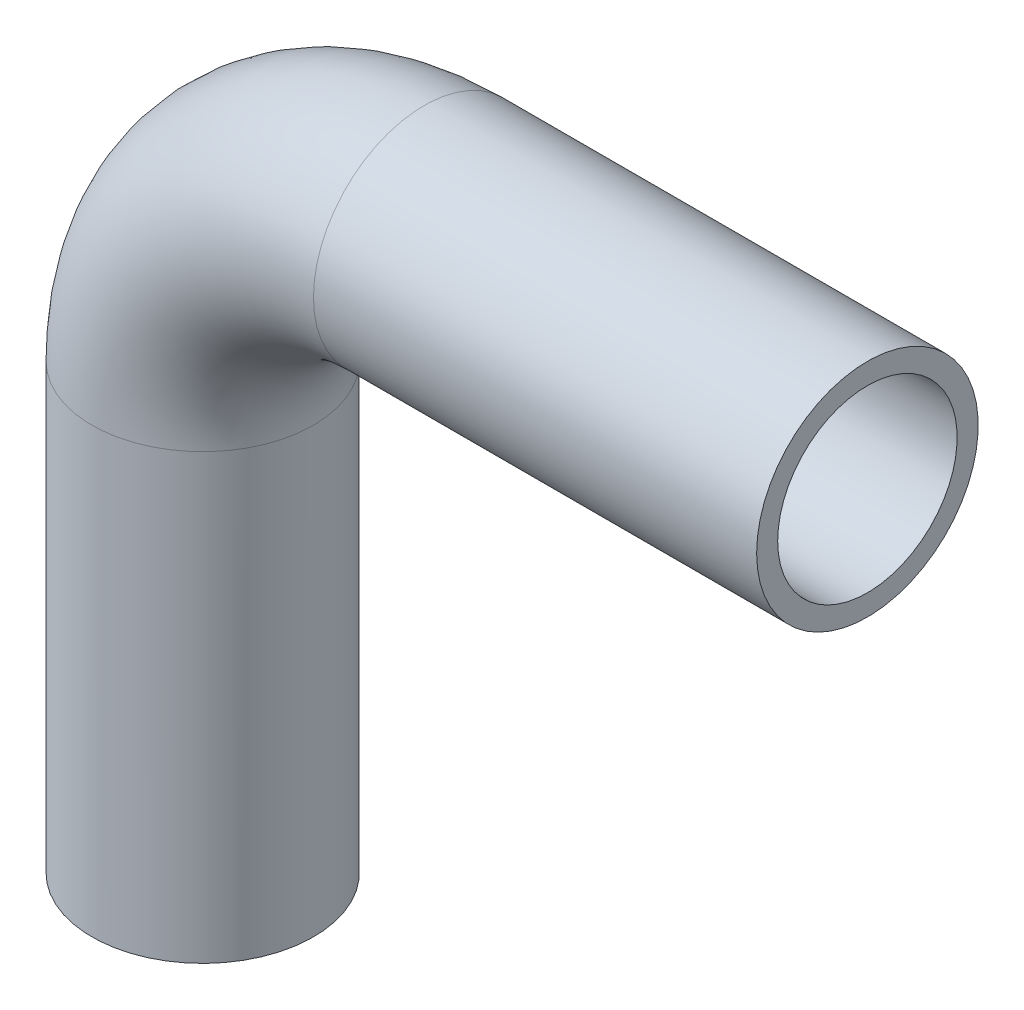
ISO-10303-21;
HEADER;
FILE_DESCRIPTION(('STEP AP214'),'2;1');
FILE_NAME('part.step','',(''),(''),'','','');
FILE_SCHEMA(('AUTOMOTIVE_DESIGN { 1 0 10303 214 1 1 1 1 }'));
ENDSEC;
DATA;
#1=APPLICATION_CONTEXT('core data for automotive mechanical design processes');
#2=APPLICATION_PROTOCOL_DEFINITION('international standard','automotive_design',2000,#1);
#3=PRODUCT_CONTEXT('',#1,'mechanical');
#4=PRODUCT('Part','Part','',(#3));
#5=PRODUCT_RELATED_PRODUCT_CATEGORY('part','',(#4));
#6=PRODUCT_DEFINITION_FORMATION('','',#4);
#7=PRODUCT_DEFINITION_CONTEXT('part definition',#1,'design');
#8=PRODUCT_DEFINITION('design','',#6,#7);
#9=PRODUCT_DEFINITION_SHAPE('','',#8);
#10=(LENGTH_UNIT() NAMED_UNIT(*) SI_UNIT(.MILLI.,.METRE.));
#11=(NAMED_UNIT(*) PLANE_ANGLE_UNIT() SI_UNIT($,.RADIAN.));
#12=(NAMED_UNIT(*) SI_UNIT($,.STERADIAN.) SOLID_ANGLE_UNIT());
#13=UNCERTAINTY_MEASURE_WITH_UNIT(LENGTH_MEASURE(1.E-05),#10,'distance_accuracy_value','');
#14=(GEOMETRIC_REPRESENTATION_CONTEXT(3) GLOBAL_UNCERTAINTY_ASSIGNED_CONTEXT((#13)) GLOBAL_UNIT_ASSIGNED_CONTEXT((#10,
#11,#12)) REPRESENTATION_CONTEXT('',''));
#15=CARTESIAN_POINT('',(0.,0.,0.));
#16=DIRECTION('',(0.,0.,1.));
#17=DIRECTION('',(1.,0.,0.));
#18=AXIS2_PLACEMENT_3D('',#15,#16,#17);
#19=CARTESIAN_POINT('',(20.,40.,0.));
#20=DIRECTION('',(0.,0.,1.));
#21=DIRECTION('',(1.,0.,0.));
#22=AXIS2_PLACEMENT_3D('',#19,#20,#21);
#23=TOROIDAL_SURFACE('',#22,20.,8.1);
#24=CARTESIAN_POINT('',(20.,60.,0.));
#25=DIRECTION('',(-1.,0.,0.));
#26=DIRECTION('',(0.,1.,0.));
#27=AXIS2_PLACEMENT_3D('',#24,#25,#26);
#28=CIRCLE('',#27,8.1);
#29=CARTESIAN_POINT('',(20.,68.1,0.));
#30=VERTEX_POINT('',#29);
#31=EDGE_CURVE('E33',#30,#30,#28,.T.);
#32=ORIENTED_EDGE('',*,*,#31,.F.);
#33=EDGE_LOOP('',(#32));
#34=FACE_BOUND('',#33,.T.);
#35=CARTESIAN_POINT('',(0.,40.,0.));
#36=DIRECTION('',(0.,-1.,0.));
#37=DIRECTION('',(-1.,0.,0.));
#38=AXIS2_PLACEMENT_3D('',#35,#36,#37);
#39=CIRCLE('',#38,8.1);
#40=CARTESIAN_POINT('',(-8.1,40.,0.));
#41=VERTEX_POINT('',#40);
#42=EDGE_CURVE('E31',#41,#41,#39,.F.);
#43=ORIENTED_EDGE('',*,*,#42,.F.);
#44=EDGE_LOOP('',(#43));
#45=FACE_BOUND('',#44,.T.);
#46=ADVANCED_FACE('F13',(#34,#45),#23,.F.);
#47=CARTESIAN_POINT('',(60.,60.,0.));
#48=DIRECTION('',(-1.,0.,0.));
#49=DIRECTION('',(0.,0.,1.));
#50=AXIS2_PLACEMENT_3D('',#47,#48,#49);
#51=CYLINDRICAL_SURFACE('',#50,8.1);
#52=CARTESIAN_POINT('',(60.,60.,0.));
#53=DIRECTION('',(-1.,0.,0.));
#54=DIRECTION('',(0.,0.,1.));
#55=AXIS2_PLACEMENT_3D('',#52,#53,#54);
#56=CIRCLE('',#55,8.1);
#57=CARTESIAN_POINT('',(60.,60.,8.1));
#58=VERTEX_POINT('',#57);
#59=EDGE_CURVE('E17',#58,#58,#56,.T.);
#60=ORIENTED_EDGE('',*,*,#59,.F.);
#61=EDGE_LOOP('',(#60));
#62=FACE_BOUND('',#61,.T.);
#63=ORIENTED_EDGE('',*,*,#31,.T.);
#64=EDGE_LOOP('',(#63));
#65=FACE_BOUND('',#64,.T.);
#66=ADVANCED_FACE('F52',(#62,#65),#51,.F.);
#67=CARTESIAN_POINT('',(0.,40.,0.));
#68=DIRECTION('',(0.,-1.,0.));
#69=DIRECTION('',(0.,0.,-1.));
#70=AXIS2_PLACEMENT_3D('',#67,#68,#69);
#71=CYLINDRICAL_SURFACE('',#70,8.1);
#72=ORIENTED_EDGE('',*,*,#42,.T.);
#73=EDGE_LOOP('',(#72));
#74=FACE_BOUND('',#73,.T.);
#75=CARTESIAN_POINT('',(0.,0.,0.));
#76=DIRECTION('',(0.,-1.,0.));
#77=DIRECTION('',(0.,0.,-1.));
#78=AXIS2_PLACEMENT_3D('',#75,#76,#77);
#79=CIRCLE('',#78,8.1);
#80=CARTESIAN_POINT('',(0.,0.,-8.09999999999998));
#81=VERTEX_POINT('',#80);
#82=EDGE_CURVE('E42',#81,#81,#79,.F.);
#83=ORIENTED_EDGE('',*,*,#82,.F.);
#84=EDGE_LOOP('',(#83));
#85=FACE_BOUND('',#84,.T.);
#86=ADVANCED_FACE('F55',(#74,#85),#71,.F.);
#87=CARTESIAN_POINT('',(60.,70.,10.1200021082711));
#88=DIRECTION('',(1.,0.,0.));
#89=DIRECTION('',(0.,-1.,0.));
#90=AXIS2_PLACEMENT_3D('',#87,#88,#89);
#91=PLANE('',#90);
#92=ORIENTED_EDGE('',*,*,#59,.T.);
#93=EDGE_LOOP('',(#92));
#94=FACE_BOUND('',#93,.T.);
#95=CARTESIAN_POINT('',(60.,60.,0.));
#96=DIRECTION('',(-1.,0.,0.));
#97=DIRECTION('',(0.,0.,1.));
#98=AXIS2_PLACEMENT_3D('',#95,#96,#97);
#99=CIRCLE('',#98,10.);
#100=CARTESIAN_POINT('',(60.,60.,10.));
#101=VERTEX_POINT('',#100);
#102=EDGE_CURVE('E40',#101,#101,#99,.T.);
#103=ORIENTED_EDGE('',*,*,#102,.F.);
#104=EDGE_LOOP('',(#103));
#105=FACE_BOUND('',#104,.T.);
#106=ADVANCED_FACE('F49',(#94,#105),#91,.T.);
#107=CARTESIAN_POINT('',(10.,0.,10.1200021082709));
#108=DIRECTION('',(0.,-1.,0.));
#109=DIRECTION('',(-1.,0.,0.));
#110=AXIS2_PLACEMENT_3D('',#107,#108,#109);
#111=PLANE('',#110);
#112=ORIENTED_EDGE('',*,*,#82,.T.);
#113=EDGE_LOOP('',(#112));
#114=FACE_BOUND('',#113,.T.);
#115=CARTESIAN_POINT('',(0.,0.,0.));
#116=DIRECTION('',(0.,-1.,0.));
#117=DIRECTION('',(0.,0.,-1.));
#118=AXIS2_PLACEMENT_3D('',#115,#116,#117);
#119=CIRCLE('',#118,10.);
#120=CARTESIAN_POINT('',(0.,0.,-10.));
#121=VERTEX_POINT('',#120);
#122=EDGE_CURVE('E26',#121,#121,#119,.F.);
#123=ORIENTED_EDGE('',*,*,#122,.F.);
#124=EDGE_LOOP('',(#123));
#125=FACE_BOUND('',#124,.T.);
#126=ADVANCED_FACE('F69',(#114,#125),#111,.T.);
#127=CARTESIAN_POINT('',(20.,60.,0.));
#128=DIRECTION('',(-1.,0.,0.));
#129=DIRECTION('',(0.,0.,1.));
#130=AXIS2_PLACEMENT_3D('',#127,#128,#129);
#131=CYLINDRICAL_SURFACE('',#130,10.);
#132=ORIENTED_EDGE('',*,*,#102,.T.);
#133=EDGE_LOOP('',(#132));
#134=FACE_BOUND('',#133,.T.);
#135=CARTESIAN_POINT('',(20.,60.,0.));
#136=DIRECTION('',(-1.,0.,0.));
#137=DIRECTION('',(0.,-1.,0.));
#138=AXIS2_PLACEMENT_3D('',#135,#136,#137);
#139=CIRCLE('',#138,10.);
#140=CARTESIAN_POINT('',(20.,50.,0.));
#141=VERTEX_POINT('',#140);
#142=EDGE_CURVE('E21',#141,#141,#139,.T.);
#143=ORIENTED_EDGE('',*,*,#142,.F.);
#144=EDGE_LOOP('',(#143));
#145=FACE_BOUND('',#144,.T.);
#146=ADVANCED_FACE('F79',(#134,#145),#131,.T.);
#147=CARTESIAN_POINT('',(0.,0.,0.));
#148=DIRECTION('',(0.,-1.,0.));
#149=DIRECTION('',(0.,0.,-1.));
#150=AXIS2_PLACEMENT_3D('',#147,#148,#149);
#151=CYLINDRICAL_SURFACE('',#150,10.);
#152=CARTESIAN_POINT('',(0.,40.,0.));
#153=DIRECTION('',(0.,-1.,0.));
#154=DIRECTION('',(1.,0.,0.));
#155=AXIS2_PLACEMENT_3D('',#152,#153,#154);
#156=CIRCLE('',#155,10.);
#157=CARTESIAN_POINT('',(10.,40.,0.));
#158=VERTEX_POINT('',#157);
#159=EDGE_CURVE('E8',#158,#158,#156,.F.);
#160=ORIENTED_EDGE('',*,*,#159,.F.);
#161=EDGE_LOOP('',(#160));
#162=FACE_BOUND('',#161,.T.);
#163=ORIENTED_EDGE('',*,*,#122,.T.);
#164=EDGE_LOOP('',(#163));
#165=FACE_BOUND('',#164,.T.);
#166=ADVANCED_FACE('F73',(#162,#165),#151,.T.);
#167=CARTESIAN_POINT('',(20.,40.,0.));
#168=DIRECTION('',(0.,0.,1.));
#169=DIRECTION('',(1.,0.,0.));
#170=AXIS2_PLACEMENT_3D('',#167,#168,#169);
#171=TOROIDAL_SURFACE('',#170,20.,10.);
#172=ORIENTED_EDGE('',*,*,#142,.T.);
#173=EDGE_LOOP('',(#172));
#174=FACE_BOUND('',#173,.T.);
#175=ORIENTED_EDGE('',*,*,#159,.T.);
#176=EDGE_LOOP('',(#175));
#177=FACE_BOUND('',#176,.T.);
#178=ADVANCED_FACE('F71',(#174,#177),#171,.T.);
#179=CLOSED_SHELL('',(#46,#66,#86,#106,#126,#146,#166,#178));
#180=MANIFOLD_SOLID_BREP('B1',#179);
#181=ADVANCED_BREP_SHAPE_REPRESENTATION('',(#18,#180),#14);
#182=SHAPE_DEFINITION_REPRESENTATION(#9,#181);
ENDSEC;
END-ISO-10303-21;
